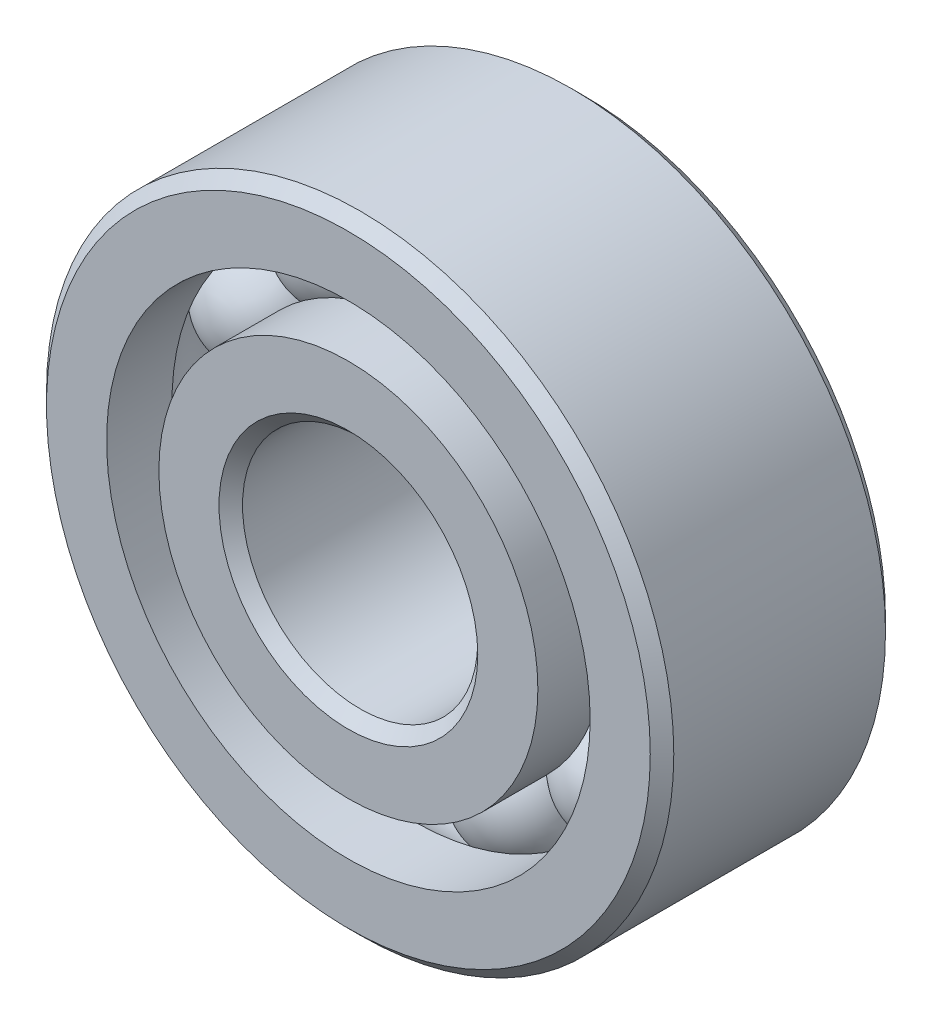
ISO-10303-21;
HEADER;
FILE_DESCRIPTION(('STEP AP214'),'2;1');
FILE_NAME('part.step','',(''),(''),'','','');
FILE_SCHEMA(('AUTOMOTIVE_DESIGN { 1 0 10303 214 1 1 1 1 }'));
ENDSEC;
DATA;
#1=APPLICATION_CONTEXT('core data for automotive mechanical design processes');
#2=APPLICATION_PROTOCOL_DEFINITION('international standard','automotive_design',2000,#1);
#3=PRODUCT_CONTEXT('',#1,'mechanical');
#4=PRODUCT('Part','Part','',(#3));
#5=PRODUCT_RELATED_PRODUCT_CATEGORY('part','',(#4));
#6=PRODUCT_DEFINITION_FORMATION('','',#4);
#7=PRODUCT_DEFINITION_CONTEXT('part definition',#1,'design');
#8=PRODUCT_DEFINITION('design','',#6,#7);
#9=PRODUCT_DEFINITION_SHAPE('','',#8);
#10=(LENGTH_UNIT() NAMED_UNIT(*) SI_UNIT(.MILLI.,.METRE.));
#11=(NAMED_UNIT(*) PLANE_ANGLE_UNIT() SI_UNIT($,.RADIAN.));
#12=(NAMED_UNIT(*) SI_UNIT($,.STERADIAN.) SOLID_ANGLE_UNIT());
#13=UNCERTAINTY_MEASURE_WITH_UNIT(LENGTH_MEASURE(1.E-05),#10,'distance_accuracy_value','');
#14=(GEOMETRIC_REPRESENTATION_CONTEXT(3) GLOBAL_UNCERTAINTY_ASSIGNED_CONTEXT((#13)) GLOBAL_UNIT_ASSIGNED_CONTEXT((#10,
#11,#12)) REPRESENTATION_CONTEXT('',''));
#15=CARTESIAN_POINT('',(0.,0.,0.));
#16=DIRECTION('',(0.,0.,1.));
#17=DIRECTION('',(1.,0.,0.));
#18=AXIS2_PLACEMENT_3D('',#15,#16,#17);
#19=CARTESIAN_POINT('',(-1.48676224800286,2.31344721528577,0.));
#20=DIRECTION('',(0.,0.,1.));
#21=DIRECTION('',(-0.540640817455587,0.841253532831188,0.));
#22=AXIS2_PLACEMENT_3D('',#19,#20,#21);
#23=SPHERICAL_SURFACE('',#22,0.74535599249993);
#24=CARTESIAN_POINT('',(-1.48676224800286,2.31344721528577,0.74535599249993));
#25=VERTEX_POINT('',#24);
#26=VERTEX_LOOP('',#25);
#27=FACE_BOUND('',#26,.T.);
#28=ADVANCED_FACE('F39',(#27),#23,.T.);
#29=CLOSED_SHELL('',(#28));
#30=MANIFOLD_SOLID_BREP('B2',#29);
#31=CARTESIAN_POINT('',(-2.50148798722491,1.14239128575522,0.));
#32=DIRECTION('',(0.,0.,1.));
#33=DIRECTION('',(-0.909631995354514,0.415415013001897,0.));
#34=AXIS2_PLACEMENT_3D('',#31,#32,#33);
#35=SPHERICAL_SURFACE('',#34,0.74535599249993);
#36=CARTESIAN_POINT('',(-2.50148798722491,1.14239128575522,0.74535599249993));
#37=VERTEX_POINT('',#36);
#38=VERTEX_LOOP('',#37);
#39=FACE_BOUND('',#38,.T.);
#40=ADVANCED_FACE('F72',(#39),#35,.T.);
#41=CLOSED_SHELL('',(#40));
#42=MANIFOLD_SOLID_BREP('B6',#41);
#43=CARTESIAN_POINT('',(-2.72200896517257,-0.391365805251508,0.));
#44=DIRECTION('',(0.,0.,1.));
#45=DIRECTION('',(-0.989821441880934,-0.142314838273276,0.));
#46=AXIS2_PLACEMENT_3D('',#43,#44,#45);
#47=SPHERICAL_SURFACE('',#46,0.74535599249993);
#48=CARTESIAN_POINT('',(-2.72200896517257,-0.391365805251508,0.74535599249993));
#49=VERTEX_POINT('',#48);
#50=VERTEX_LOOP('',#49);
#51=FACE_BOUND('',#50,.T.);
#52=ADVANCED_FACE('F105',(#51),#47,.T.);
#53=CLOSED_SHELL('',(#52));
#54=MANIFOLD_SOLID_BREP('B35',#53);
#55=CARTESIAN_POINT('',(-2.07831132947423,-1.80086701834952,0.));
#56=DIRECTION('',(0.,0.,1.));
#57=DIRECTION('',(-0.755749574354264,-0.654860733945279,0.));
#58=AXIS2_PLACEMENT_3D('',#55,#56,#57);
#59=SPHERICAL_SURFACE('',#58,0.74535599249993);
#60=CARTESIAN_POINT('',(-2.07831132947423,-1.80086701834952,0.74535599249993));
#61=VERTEX_POINT('',#60);
#62=VERTEX_LOOP('',#61);
#63=FACE_BOUND('',#62,.T.);
#64=ADVANCED_FACE('F138',(#63),#59,.T.);
#65=CLOSED_SHELL('',(#64));
#66=MANIFOLD_SOLID_BREP('B68',#65);
#67=CARTESIAN_POINT('',(-0.774764531313951,-2.63860567743986,0.));
#68=DIRECTION('',(0.,0.,1.));
#69=DIRECTION('',(-0.281732556841437,-0.959492973614495,0.));
#70=AXIS2_PLACEMENT_3D('',#67,#68,#69);
#71=SPHERICAL_SURFACE('',#70,0.74535599249993);
#72=CARTESIAN_POINT('',(-0.774764531313951,-2.63860567743986,0.74535599249993));
#73=VERTEX_POINT('',#72);
#74=VERTEX_LOOP('',#73);
#75=FACE_BOUND('',#74,.T.);
#76=ADVANCED_FACE('F171',(#75),#71,.T.);
#77=CLOSED_SHELL('',(#76));
#78=MANIFOLD_SOLID_BREP('B101',#77);
#79=CARTESIAN_POINT('',(0.774764531313915,-2.63860567743987,0.));
#80=DIRECTION('',(0.,0.,1.));
#81=DIRECTION('',(0.281732556841424,-0.959492973614499,0.));
#82=AXIS2_PLACEMENT_3D('',#79,#80,#81);
#83=SPHERICAL_SURFACE('',#82,0.74535599249993);
#84=CARTESIAN_POINT('',(0.774764531313915,-2.63860567743987,0.74535599249993));
#85=VERTEX_POINT('',#84);
#86=VERTEX_LOOP('',#85);
#87=FACE_BOUND('',#86,.T.);
#88=ADVANCED_FACE('F204',(#87),#83,.T.);
#89=CLOSED_SHELL('',(#88));
#90=MANIFOLD_SOLID_BREP('B134',#89);
#91=CARTESIAN_POINT('',(2.0783113294742,-1.80086701834954,0.));
#92=DIRECTION('',(0.,0.,1.));
#93=DIRECTION('',(0.755749574354255,-0.654860733945289,0.));
#94=AXIS2_PLACEMENT_3D('',#91,#92,#93);
#95=SPHERICAL_SURFACE('',#94,0.74535599249993);
#96=CARTESIAN_POINT('',(2.0783113294742,-1.80086701834954,0.74535599249993));
#97=VERTEX_POINT('',#96);
#98=VERTEX_LOOP('',#97);
#99=FACE_BOUND('',#98,.T.);
#100=ADVANCED_FACE('F237',(#99),#95,.T.);
#101=CLOSED_SHELL('',(#100));
#102=MANIFOLD_SOLID_BREP('B167',#101);
#103=CARTESIAN_POINT('',(2.72200896517256,-0.391365805251544,0.));
#104=DIRECTION('',(0.,0.,1.));
#105=DIRECTION('',(0.989821441880932,-0.142314838273289,0.));
#106=AXIS2_PLACEMENT_3D('',#103,#104,#105);
#107=SPHERICAL_SURFACE('',#106,0.74535599249993);
#108=CARTESIAN_POINT('',(2.72200896517256,-0.391365805251544,0.74535599249993));
#109=VERTEX_POINT('',#108);
#110=VERTEX_LOOP('',#109);
#111=FACE_BOUND('',#110,.T.);
#112=ADVANCED_FACE('F270',(#111),#107,.T.);
#113=CLOSED_SHELL('',(#112));
#114=MANIFOLD_SOLID_BREP('B200',#113);
#115=CARTESIAN_POINT('',(2.50148798722493,1.14239128575518,0.));
#116=DIRECTION('',(0.,0.,1.));
#117=DIRECTION('',(0.90963199535452,0.415415013001884,0.));
#118=AXIS2_PLACEMENT_3D('',#115,#116,#117);
#119=SPHERICAL_SURFACE('',#118,0.74535599249993);
#120=CARTESIAN_POINT('',(2.50148798722493,1.14239128575518,0.74535599249993));
#121=VERTEX_POINT('',#120);
#122=VERTEX_LOOP('',#121);
#123=FACE_BOUND('',#122,.T.);
#124=ADVANCED_FACE('F303',(#123),#119,.T.);
#125=CLOSED_SHELL('',(#124));
#126=MANIFOLD_SOLID_BREP('B233',#125);
#127=CARTESIAN_POINT('',(1.4867622480029,2.31344721528575,0.));
#128=DIRECTION('',(0.,0.,1.));
#129=DIRECTION('',(0.540640817455599,0.841253532831181,0.));
#130=AXIS2_PLACEMENT_3D('',#127,#128,#129);
#131=SPHERICAL_SURFACE('',#130,0.74535599249993);
#132=CARTESIAN_POINT('',(1.4867622480029,2.31344721528575,0.74535599249993));
#133=VERTEX_POINT('',#132);
#134=VERTEX_LOOP('',#133);
#135=FACE_BOUND('',#134,.T.);
#136=ADVANCED_FACE('F336',(#135),#131,.T.);
#137=CLOSED_SHELL('',(#136));
#138=MANIFOLD_SOLID_BREP('B266',#137);
#139=CARTESIAN_POINT('',(0.,2.75,0.));
#140=DIRECTION('',(0.,0.,1.));
#141=DIRECTION('',(0.,1.,0.));
#142=AXIS2_PLACEMENT_3D('',#139,#140,#141);
#143=SPHERICAL_SURFACE('',#142,0.74535599249993);
#144=CARTESIAN_POINT('',(0.,2.75,0.74535599249993));
#145=VERTEX_POINT('',#144);
#146=VERTEX_LOOP('',#145);
#147=FACE_BOUND('',#146,.T.);
#148=ADVANCED_FACE('F371',(#147),#143,.T.);
#149=CLOSED_SHELL('',(#148));
#150=MANIFOLD_SOLID_BREP('B299',#149);
#151=CARTESIAN_POINT('',(0.,0.,1.35));
#152=DIRECTION('',(0.,0.,-1.));
#153=DIRECTION('',(-1.,0.,0.));
#154=AXIS2_PLACEMENT_3D('',#151,#152,#153);
#155=CONICAL_SURFACE('',#154,4.,0.785398163397448);
#156=CARTESIAN_POINT('',(0.,0.,1.5));
#157=DIRECTION('',(0.,0.,1.));
#158=DIRECTION('',(1.,0.,0.));
#159=AXIS2_PLACEMENT_3D('',#156,#157,#158);
#160=CIRCLE('',#159,3.85);
#161=CARTESIAN_POINT('',(3.85,0.,1.5));
#162=VERTEX_POINT('',#161);
#163=EDGE_CURVE('E418',#162,#162,#160,.T.);
#164=ORIENTED_EDGE('',*,*,#163,.F.);
#165=EDGE_LOOP('',(#164));
#166=FACE_BOUND('',#165,.T.);
#167=CARTESIAN_POINT('',(0.,0.,1.35));
#168=DIRECTION('',(0.,0.,1.));
#169=DIRECTION('',(1.,0.,0.));
#170=AXIS2_PLACEMENT_3D('',#167,#168,#169);
#171=CIRCLE('',#170,4.);
#172=CARTESIAN_POINT('',(4.,0.,1.35));
#173=VERTEX_POINT('',#172);
#174=EDGE_CURVE('E370',#173,#173,#171,.T.);
#175=ORIENTED_EDGE('',*,*,#174,.T.);
#176=EDGE_LOOP('',(#175));
#177=FACE_BOUND('',#176,.T.);
#178=ADVANCED_FACE('F390',(#166,#177),#155,.T.);
#179=CARTESIAN_POINT('',(0.,0.,1.5));
#180=DIRECTION('',(0.,0.,1.));
#181=DIRECTION('',(1.,0.,0.));
#182=AXIS2_PLACEMENT_3D('',#179,#180,#181);
#183=CYLINDRICAL_SURFACE('',#182,4.);
#184=ORIENTED_EDGE('',*,*,#174,.F.);
#185=EDGE_LOOP('',(#184));
#186=FACE_BOUND('',#185,.T.);
#187=CARTESIAN_POINT('',(0.,0.,-1.35));
#188=DIRECTION('',(0.,0.,1.));
#189=DIRECTION('',(1.,0.,0.));
#190=AXIS2_PLACEMENT_3D('',#187,#188,#189);
#191=CIRCLE('',#190,4.);
#192=CARTESIAN_POINT('',(4.,0.,-1.35));
#193=VERTEX_POINT('',#192);
#194=EDGE_CURVE('E396',#193,#193,#191,.T.);
#195=ORIENTED_EDGE('',*,*,#194,.T.);
#196=EDGE_LOOP('',(#195));
#197=FACE_BOUND('',#196,.T.);
#198=ADVANCED_FACE('F425',(#186,#197),#183,.T.);
#199=CARTESIAN_POINT('',(0.,0.,-1.5));
#200=DIRECTION('',(0.,0.,1.));
#201=DIRECTION('',(1.,0.,0.));
#202=AXIS2_PLACEMENT_3D('',#199,#200,#201);
#203=CONICAL_SURFACE('',#202,3.85,0.785398163397445);
#204=ORIENTED_EDGE('',*,*,#194,.F.);
#205=EDGE_LOOP('',(#204));
#206=FACE_BOUND('',#205,.T.);
#207=CARTESIAN_POINT('',(0.,0.,-1.5));
#208=DIRECTION('',(0.,0.,1.));
#209=DIRECTION('',(1.,0.,0.));
#210=AXIS2_PLACEMENT_3D('',#207,#208,#209);
#211=CIRCLE('',#210,3.85);
#212=CARTESIAN_POINT('',(3.85,0.,-1.5));
#213=VERTEX_POINT('',#212);
#214=EDGE_CURVE('E400',#213,#213,#211,.T.);
#215=ORIENTED_EDGE('',*,*,#214,.T.);
#216=EDGE_LOOP('',(#215));
#217=FACE_BOUND('',#216,.T.);
#218=ADVANCED_FACE('F429',(#206,#217),#203,.T.);
#219=CARTESIAN_POINT('',(0.,3.85,-1.5));
#220=DIRECTION('',(0.,0.,1.));
#221=DIRECTION('',(1.,0.,0.));
#222=AXIS2_PLACEMENT_3D('',#219,#220,#221);
#223=PLANE('',#222);
#224=ORIENTED_EDGE('',*,*,#214,.F.);
#225=EDGE_LOOP('',(#224));
#226=FACE_BOUND('',#225,.T.);
#227=CARTESIAN_POINT('',(0.,0.,-1.5));
#228=DIRECTION('',(0.,0.,1.));
#229=DIRECTION('',(1.,0.,0.));
#230=AXIS2_PLACEMENT_3D('',#227,#228,#229);
#231=CIRCLE('',#230,3.08333333333333);
#232=CARTESIAN_POINT('',(3.08333333333333,0.,-1.5));
#233=VERTEX_POINT('',#232);
#234=EDGE_CURVE('E404',#233,#233,#231,.T.);
#235=ORIENTED_EDGE('',*,*,#234,.T.);
#236=EDGE_LOOP('',(#235));
#237=FACE_BOUND('',#236,.T.);
#238=ADVANCED_FACE('F434',(#226,#237),#223,.F.);
#239=CARTESIAN_POINT('',(0.,0.,1.5));
#240=DIRECTION('',(0.,0.,1.));
#241=DIRECTION('',(1.,0.,0.));
#242=AXIS2_PLACEMENT_3D('',#239,#240,#241);
#243=CYLINDRICAL_SURFACE('',#242,3.08333333333333);
#244=ORIENTED_EDGE('',*,*,#234,.F.);
#245=EDGE_LOOP('',(#244));
#246=FACE_BOUND('',#245,.T.);
#247=CARTESIAN_POINT('',(0.,0.,-0.666666666666667));
#248=DIRECTION('',(0.,0.,1.));
#249=DIRECTION('',(1.,0.,0.));
#250=AXIS2_PLACEMENT_3D('',#247,#248,#249);
#251=CIRCLE('',#250,3.08333333333333);
#252=CARTESIAN_POINT('',(3.08333333333333,0.,-0.666666666666667));
#253=VERTEX_POINT('',#252);
#254=EDGE_CURVE('E409',#253,#253,#251,.T.);
#255=ORIENTED_EDGE('',*,*,#254,.T.);
#256=EDGE_LOOP('',(#255));
#257=FACE_BOUND('',#256,.T.);
#258=ADVANCED_FACE('F440',(#246,#257),#243,.F.);
#259=CARTESIAN_POINT('',(0.,0.,0.));
#260=DIRECTION('',(0.,0.,1.));
#261=DIRECTION('',(1.,0.,0.));
#262=AXIS2_PLACEMENT_3D('',#259,#260,#261);
#263=TOROIDAL_SURFACE('',#262,2.75,0.745355992499928);
#264=ORIENTED_EDGE('',*,*,#254,.F.);
#265=EDGE_LOOP('',(#264));
#266=FACE_BOUND('',#265,.T.);
#267=CARTESIAN_POINT('',(0.,0.,0.666666666666667));
#268=DIRECTION('',(0.,0.,1.));
#269=DIRECTION('',(1.,0.,0.));
#270=AXIS2_PLACEMENT_3D('',#267,#268,#269);
#271=CIRCLE('',#270,3.08333333333333);
#272=CARTESIAN_POINT('',(3.08333333333333,0.,0.666666666666667));
#273=VERTEX_POINT('',#272);
#274=EDGE_CURVE('E412',#273,#273,#271,.T.);
#275=ORIENTED_EDGE('',*,*,#274,.T.);
#276=EDGE_LOOP('',(#275));
#277=FACE_BOUND('',#276,.T.);
#278=ADVANCED_FACE('F444',(#266,#277),#263,.F.);
#279=CARTESIAN_POINT('',(0.,0.,1.5));
#280=DIRECTION('',(0.,0.,1.));
#281=DIRECTION('',(1.,0.,0.));
#282=AXIS2_PLACEMENT_3D('',#279,#280,#281);
#283=CYLINDRICAL_SURFACE('',#282,3.08333333333333);
#284=ORIENTED_EDGE('',*,*,#274,.F.);
#285=EDGE_LOOP('',(#284));
#286=FACE_BOUND('',#285,.T.);
#287=CARTESIAN_POINT('',(0.,0.,1.5));
#288=DIRECTION('',(0.,0.,1.));
#289=DIRECTION('',(1.,0.,0.));
#290=AXIS2_PLACEMENT_3D('',#287,#288,#289);
#291=CIRCLE('',#290,3.08333333333333);
#292=CARTESIAN_POINT('',(3.08333333333333,0.,1.5));
#293=VERTEX_POINT('',#292);
#294=EDGE_CURVE('E415',#293,#293,#291,.T.);
#295=ORIENTED_EDGE('',*,*,#294,.T.);
#296=EDGE_LOOP('',(#295));
#297=FACE_BOUND('',#296,.T.);
#298=ADVANCED_FACE('F448',(#286,#297),#283,.F.);
#299=CARTESIAN_POINT('',(0.,3.85,1.5));
#300=DIRECTION('',(0.,0.,-1.));
#301=DIRECTION('',(-1.,0.,0.));
#302=AXIS2_PLACEMENT_3D('',#299,#300,#301);
#303=PLANE('',#302);
#304=ORIENTED_EDGE('',*,*,#294,.F.);
#305=EDGE_LOOP('',(#304));
#306=FACE_BOUND('',#305,.T.);
#307=ORIENTED_EDGE('',*,*,#163,.T.);
#308=EDGE_LOOP('',(#307));
#309=FACE_BOUND('',#308,.T.);
#310=ADVANCED_FACE('F422',(#306,#309),#303,.F.);
#311=CLOSED_SHELL('',(#178,#198,#218,#238,#258,#278,#298,#310));
#312=MANIFOLD_SOLID_BREP('B332',#311);
#313=CARTESIAN_POINT('',(0.,2.41666666666667,1.5));
#314=DIRECTION('',(0.,0.,-1.));
#315=DIRECTION('',(-1.,0.,0.));
#316=AXIS2_PLACEMENT_3D('',#313,#314,#315);
#317=PLANE('',#316);
#318=CARTESIAN_POINT('',(0.,0.,1.5));
#319=DIRECTION('',(0.,0.,1.));
#320=DIRECTION('',(1.,0.,0.));
#321=AXIS2_PLACEMENT_3D('',#318,#319,#320);
#322=CIRCLE('',#321,1.65);
#323=CARTESIAN_POINT('',(1.65,0.,1.5));
#324=VERTEX_POINT('',#323);
#325=EDGE_CURVE('E389',#324,#324,#322,.T.);
#326=ORIENTED_EDGE('',*,*,#325,.F.);
#327=EDGE_LOOP('',(#326));
#328=FACE_BOUND('',#327,.T.);
#329=CARTESIAN_POINT('',(0.,0.,1.5));
#330=DIRECTION('',(0.,0.,1.));
#331=DIRECTION('',(1.,0.,0.));
#332=AXIS2_PLACEMENT_3D('',#329,#330,#331);
#333=CIRCLE('',#332,2.41666666666667);
#334=CARTESIAN_POINT('',(2.41666666666667,0.,1.5));
#335=VERTEX_POINT('',#334);
#336=EDGE_CURVE('E539',#335,#335,#333,.T.);
#337=ORIENTED_EDGE('',*,*,#336,.T.);
#338=EDGE_LOOP('',(#337));
#339=FACE_BOUND('',#338,.T.);
#340=ADVANCED_FACE('F511',(#328,#339),#317,.F.);
#341=CARTESIAN_POINT('',(0.,0.,1.5));
#342=DIRECTION('',(0.,0.,1.));
#343=DIRECTION('',(1.,0.,0.));
#344=AXIS2_PLACEMENT_3D('',#341,#342,#343);
#345=CONICAL_SURFACE('',#344,1.65,0.785398163397447);
#346=CARTESIAN_POINT('',(0.,0.,1.35));
#347=DIRECTION('',(0.,0.,1.));
#348=DIRECTION('',(1.,0.,0.));
#349=AXIS2_PLACEMENT_3D('',#346,#347,#348);
#350=CIRCLE('',#349,1.5);
#351=CARTESIAN_POINT('',(1.5,0.,1.35));
#352=VERTEX_POINT('',#351);
#353=EDGE_CURVE('E517',#352,#352,#350,.T.);
#354=ORIENTED_EDGE('',*,*,#353,.F.);
#355=EDGE_LOOP('',(#354));
#356=FACE_BOUND('',#355,.T.);
#357=ORIENTED_EDGE('',*,*,#325,.T.);
#358=EDGE_LOOP('',(#357));
#359=FACE_BOUND('',#358,.T.);
#360=ADVANCED_FACE('F576',(#356,#359),#345,.F.);
#361=CARTESIAN_POINT('',(0.,0.,1.5));
#362=DIRECTION('',(0.,0.,1.));
#363=DIRECTION('',(1.,0.,0.));
#364=AXIS2_PLACEMENT_3D('',#361,#362,#363);
#365=CYLINDRICAL_SURFACE('',#364,1.5);
#366=CARTESIAN_POINT('',(0.,0.,-1.35));
#367=DIRECTION('',(0.,0.,1.));
#368=DIRECTION('',(1.,0.,0.));
#369=AXIS2_PLACEMENT_3D('',#366,#367,#368);
#370=CIRCLE('',#369,1.5);
#371=CARTESIAN_POINT('',(1.5,0.,-1.35));
#372=VERTEX_POINT('',#371);
#373=EDGE_CURVE('E521',#372,#372,#370,.T.);
#374=ORIENTED_EDGE('',*,*,#373,.F.);
#375=EDGE_LOOP('',(#374));
#376=FACE_BOUND('',#375,.T.);
#377=ORIENTED_EDGE('',*,*,#353,.T.);
#378=EDGE_LOOP('',(#377));
#379=FACE_BOUND('',#378,.T.);
#380=ADVANCED_FACE('F571',(#376,#379),#365,.F.);
#381=CARTESIAN_POINT('',(0.,0.,-1.35));
#382=DIRECTION('',(0.,0.,-1.));
#383=DIRECTION('',(-1.,0.,0.));
#384=AXIS2_PLACEMENT_3D('',#381,#382,#383);
#385=CONICAL_SURFACE('',#384,1.5,0.785398163397447);
#386=CARTESIAN_POINT('',(0.,0.,-1.5));
#387=DIRECTION('',(0.,0.,1.));
#388=DIRECTION('',(1.,0.,0.));
#389=AXIS2_PLACEMENT_3D('',#386,#387,#388);
#390=CIRCLE('',#389,1.65);
#391=CARTESIAN_POINT('',(1.65,0.,-1.5));
#392=VERTEX_POINT('',#391);
#393=EDGE_CURVE('E525',#392,#392,#390,.T.);
#394=ORIENTED_EDGE('',*,*,#393,.F.);
#395=EDGE_LOOP('',(#394));
#396=FACE_BOUND('',#395,.T.);
#397=ORIENTED_EDGE('',*,*,#373,.T.);
#398=EDGE_LOOP('',(#397));
#399=FACE_BOUND('',#398,.T.);
#400=ADVANCED_FACE('F565',(#396,#399),#385,.F.);
#401=CARTESIAN_POINT('',(0.,2.41666666666667,-1.5));
#402=DIRECTION('',(0.,0.,1.));
#403=DIRECTION('',(1.,0.,0.));
#404=AXIS2_PLACEMENT_3D('',#401,#402,#403);
#405=PLANE('',#404);
#406=CARTESIAN_POINT('',(0.,0.,-1.5));
#407=DIRECTION('',(0.,0.,1.));
#408=DIRECTION('',(1.,0.,0.));
#409=AXIS2_PLACEMENT_3D('',#406,#407,#408);
#410=CIRCLE('',#409,2.41666666666667);
#411=CARTESIAN_POINT('',(2.41666666666667,0.,-1.5));
#412=VERTEX_POINT('',#411);
#413=EDGE_CURVE('E530',#412,#412,#410,.T.);
#414=ORIENTED_EDGE('',*,*,#413,.F.);
#415=EDGE_LOOP('',(#414));
#416=FACE_BOUND('',#415,.T.);
#417=ORIENTED_EDGE('',*,*,#393,.T.);
#418=EDGE_LOOP('',(#417));
#419=FACE_BOUND('',#418,.T.);
#420=ADVANCED_FACE('F559',(#416,#419),#405,.F.);
#421=CARTESIAN_POINT('',(0.,0.,1.5));
#422=DIRECTION('',(0.,0.,1.));
#423=DIRECTION('',(1.,0.,0.));
#424=AXIS2_PLACEMENT_3D('',#421,#422,#423);
#425=CYLINDRICAL_SURFACE('',#424,2.41666666666667);
#426=CARTESIAN_POINT('',(0.,0.,-0.666666666666667));
#427=DIRECTION('',(0.,0.,1.));
#428=DIRECTION('',(1.,0.,0.));
#429=AXIS2_PLACEMENT_3D('',#426,#427,#428);
#430=CIRCLE('',#429,2.41666666666667);
#431=CARTESIAN_POINT('',(2.41666666666667,0.,-0.666666666666667));
#432=VERTEX_POINT('',#431);
#433=EDGE_CURVE('E533',#432,#432,#430,.T.);
#434=ORIENTED_EDGE('',*,*,#433,.F.);
#435=EDGE_LOOP('',(#434));
#436=FACE_BOUND('',#435,.T.);
#437=ORIENTED_EDGE('',*,*,#413,.T.);
#438=EDGE_LOOP('',(#437));
#439=FACE_BOUND('',#438,.T.);
#440=ADVANCED_FACE('F553',(#436,#439),#425,.T.);
#441=CARTESIAN_POINT('',(0.,0.,0.));
#442=DIRECTION('',(0.,0.,1.));
#443=DIRECTION('',(1.,0.,0.));
#444=AXIS2_PLACEMENT_3D('',#441,#442,#443);
#445=TOROIDAL_SURFACE('',#444,2.75,0.74535599249993);
#446=CARTESIAN_POINT('',(0.,0.,0.666666666666667));
#447=DIRECTION('',(0.,0.,1.));
#448=DIRECTION('',(1.,0.,0.));
#449=AXIS2_PLACEMENT_3D('',#446,#447,#448);
#450=CIRCLE('',#449,2.41666666666667);
#451=CARTESIAN_POINT('',(2.41666666666667,0.,0.666666666666667));
#452=VERTEX_POINT('',#451);
#453=EDGE_CURVE('E536',#452,#452,#450,.T.);
#454=ORIENTED_EDGE('',*,*,#453,.F.);
#455=EDGE_LOOP('',(#454));
#456=FACE_BOUND('',#455,.T.);
#457=ORIENTED_EDGE('',*,*,#433,.T.);
#458=EDGE_LOOP('',(#457));
#459=FACE_BOUND('',#458,.T.);
#460=ADVANCED_FACE('F547',(#456,#459),#445,.F.);
#461=CARTESIAN_POINT('',(0.,0.,1.5));
#462=DIRECTION('',(0.,0.,1.));
#463=DIRECTION('',(1.,0.,0.));
#464=AXIS2_PLACEMENT_3D('',#461,#462,#463);
#465=CYLINDRICAL_SURFACE('',#464,2.41666666666667);
#466=ORIENTED_EDGE('',*,*,#336,.F.);
#467=EDGE_LOOP('',(#466));
#468=FACE_BOUND('',#467,.T.);
#469=ORIENTED_EDGE('',*,*,#453,.T.);
#470=EDGE_LOOP('',(#469));
#471=FACE_BOUND('',#470,.T.);
#472=ADVANCED_FACE('F544',(#468,#471),#465,.T.);
#473=CLOSED_SHELL('',(#340,#360,#380,#400,#420,#440,#460,#472));
#474=MANIFOLD_SOLID_BREP('B365',#473);
#475=ADVANCED_BREP_SHAPE_REPRESENTATION('',(#18,#30,#42,#54,#66,#78,#90,#102,#114,#126,#138,
#150,#312,#474),#14);
#476=SHAPE_DEFINITION_REPRESENTATION(#9,#475);
ENDSEC;
END-ISO-10303-21;
